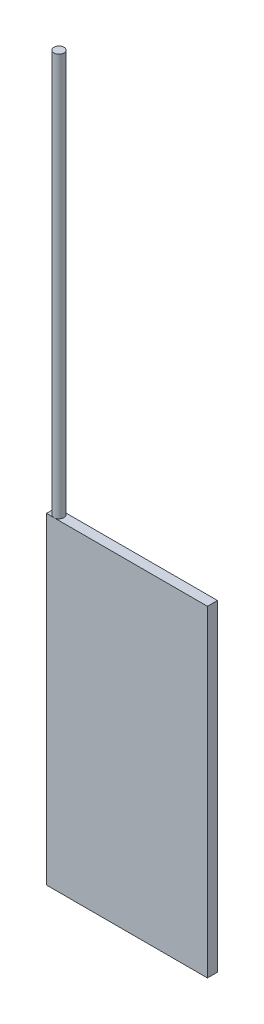
ISO-10303-21;
HEADER;
FILE_DESCRIPTION(('STEP AP214'),'2;1');
FILE_NAME('part.step','',(''),(''),'','','');
FILE_SCHEMA(('AUTOMOTIVE_DESIGN { 1 0 10303 214 1 1 1 1 }'));
ENDSEC;
DATA;
#1=APPLICATION_CONTEXT('core data for automotive mechanical design processes');
#2=APPLICATION_PROTOCOL_DEFINITION('international standard','automotive_design',2000,#1);
#3=PRODUCT_CONTEXT('',#1,'mechanical');
#4=PRODUCT('Part','Part','',(#3));
#5=PRODUCT_RELATED_PRODUCT_CATEGORY('part','',(#4));
#6=PRODUCT_DEFINITION_FORMATION('','',#4);
#7=PRODUCT_DEFINITION_CONTEXT('part definition',#1,'design');
#8=PRODUCT_DEFINITION('design','',#6,#7);
#9=PRODUCT_DEFINITION_SHAPE('','',#8);
#10=(LENGTH_UNIT() NAMED_UNIT(*) SI_UNIT(.MILLI.,.METRE.));
#11=(NAMED_UNIT(*) PLANE_ANGLE_UNIT() SI_UNIT($,.RADIAN.));
#12=(NAMED_UNIT(*) SI_UNIT($,.STERADIAN.) SOLID_ANGLE_UNIT());
#13=UNCERTAINTY_MEASURE_WITH_UNIT(LENGTH_MEASURE(1.E-05),#10,'distance_accuracy_value','');
#14=(GEOMETRIC_REPRESENTATION_CONTEXT(3) GLOBAL_UNCERTAINTY_ASSIGNED_CONTEXT((#13)) GLOBAL_UNIT_ASSIGNED_CONTEXT((#10,
#11,#12)) REPRESENTATION_CONTEXT('',''));
#15=CARTESIAN_POINT('',(0.,0.,0.));
#16=DIRECTION('',(0.,0.,1.));
#17=DIRECTION('',(1.,0.,0.));
#18=AXIS2_PLACEMENT_3D('',#15,#16,#17);
#19=CARTESIAN_POINT('',(0.,101.6,3.175));
#20=DIRECTION('',(0.,-1.,0.));
#21=DIRECTION('',(0.,0.,-1.));
#22=AXIS2_PLACEMENT_3D('',#19,#20,#21);
#23=PLANE('',#22);
#24=CARTESIAN_POINT('',(2.33921930998937,101.6,1.5875));
#25=DIRECTION('',(0.,1.,0.));
#26=DIRECTION('',(0.,0.,1.));
#27=AXIS2_PLACEMENT_3D('',#24,#25,#26);
#28=CIRCLE('',#27,1.5875);
#29=CARTESIAN_POINT('',(2.33921930998937,101.6,3.175));
#30=VERTEX_POINT('',#29);
#31=CARTESIAN_POINT('',(2.33921930998937,101.6,0.));
#32=VERTEX_POINT('',#31);
#33=EDGE_CURVE('E49',#30,#32,#28,.T.);
#34=ORIENTED_EDGE('',*,*,#33,.F.);
#35=DIRECTION('',(-1.,0.,0.));
#36=VECTOR('',#35,1.);
#37=CARTESIAN_POINT('',(0.,101.6,3.175));
#38=LINE('',#37,#36);
#39=CARTESIAN_POINT('',(50.8,101.6,3.175));
#40=VERTEX_POINT('',#39);
#41=EDGE_CURVE('E101',#40,#30,#38,.T.);
#42=ORIENTED_EDGE('',*,*,#41,.F.);
#43=DIRECTION('',(0.,0.,-1.));
#44=VECTOR('',#43,1.);
#45=CARTESIAN_POINT('',(50.8,101.6,3.175));
#46=LINE('',#45,#44);
#47=CARTESIAN_POINT('',(50.8,101.6,0.));
#48=VERTEX_POINT('',#47);
#49=EDGE_CURVE('E165',#40,#48,#46,.T.);
#50=ORIENTED_EDGE('',*,*,#49,.T.);
#51=DIRECTION('',(-1.,0.,0.));
#52=VECTOR('',#51,1.);
#53=CARTESIAN_POINT('',(0.,101.6,0.));
#54=LINE('',#53,#52);
#55=EDGE_CURVE('E118',#48,#32,#54,.T.);
#56=ORIENTED_EDGE('',*,*,#55,.T.);
#57=EDGE_LOOP('',(#34,#42,#50,#56));
#58=FACE_BOUND('',#57,.T.);
#59=ADVANCED_FACE('F38',(#58),#23,.F.);
#60=EDGE_CURVE('E11',#32,#30,#28,.T.);
#61=ORIENTED_EDGE('',*,*,#60,.F.);
#62=CARTESIAN_POINT('',(0.,101.6,0.));
#63=VERTEX_POINT('',#62);
#64=EDGE_CURVE('E88',#32,#63,#54,.T.);
#65=ORIENTED_EDGE('',*,*,#64,.T.);
#66=DIRECTION('',(0.,0.,-1.));
#67=VECTOR('',#66,1.);
#68=CARTESIAN_POINT('',(0.,101.6,3.175));
#69=LINE('',#68,#67);
#70=CARTESIAN_POINT('',(0.,101.6,3.175));
#71=VERTEX_POINT('',#70);
#72=EDGE_CURVE('E110',#71,#63,#69,.T.);
#73=ORIENTED_EDGE('',*,*,#72,.F.);
#74=EDGE_CURVE('E68',#30,#71,#38,.T.);
#75=ORIENTED_EDGE('',*,*,#74,.F.);
#76=EDGE_LOOP('',(#61,#65,#73,#75));
#77=FACE_BOUND('',#76,.T.);
#78=ADVANCED_FACE('F112',(#77),#23,.F.);
#79=CARTESIAN_POINT('',(0.,0.,3.175));
#80=DIRECTION('',(1.,0.,0.));
#81=DIRECTION('',(0.,0.,-1.));
#82=AXIS2_PLACEMENT_3D('',#79,#80,#81);
#83=PLANE('',#82);
#84=DIRECTION('',(0.,-1.,0.));
#85=VECTOR('',#84,1.);
#86=CARTESIAN_POINT('',(0.,0.,0.));
#87=LINE('',#86,#85);
#88=CARTESIAN_POINT('',(0.,0.,0.));
#89=VERTEX_POINT('',#88);
#90=EDGE_CURVE('E162',#63,#89,#87,.T.);
#91=ORIENTED_EDGE('',*,*,#90,.T.);
#92=DIRECTION('',(0.,0.,-1.));
#93=VECTOR('',#92,1.);
#94=CARTESIAN_POINT('',(0.,0.,3.175));
#95=LINE('',#94,#93);
#96=CARTESIAN_POINT('',(0.,0.,3.175));
#97=VERTEX_POINT('',#96);
#98=EDGE_CURVE('E42',#97,#89,#95,.T.);
#99=ORIENTED_EDGE('',*,*,#98,.F.);
#100=DIRECTION('',(0.,-1.,0.));
#101=VECTOR('',#100,1.);
#102=CARTESIAN_POINT('',(0.,0.,3.175));
#103=LINE('',#102,#101);
#104=EDGE_CURVE('E173',#71,#97,#103,.T.);
#105=ORIENTED_EDGE('',*,*,#104,.F.);
#106=ORIENTED_EDGE('',*,*,#72,.T.);
#107=EDGE_LOOP('',(#91,#99,#105,#106));
#108=FACE_BOUND('',#107,.T.);
#109=ADVANCED_FACE('F40',(#108),#83,.F.);
#110=CARTESIAN_POINT('',(0.,0.,3.175));
#111=DIRECTION('',(0.,1.,0.));
#112=DIRECTION('',(0.,0.,1.));
#113=AXIS2_PLACEMENT_3D('',#110,#111,#112);
#114=PLANE('',#113);
#115=DIRECTION('',(1.,0.,0.));
#116=VECTOR('',#115,1.);
#117=CARTESIAN_POINT('',(0.,0.,0.));
#118=LINE('',#117,#116);
#119=CARTESIAN_POINT('',(50.8,0.,0.));
#120=VERTEX_POINT('',#119);
#121=EDGE_CURVE('E153',#89,#120,#118,.T.);
#122=ORIENTED_EDGE('',*,*,#121,.T.);
#123=DIRECTION('',(0.,0.,-1.));
#124=VECTOR('',#123,1.);
#125=CARTESIAN_POINT('',(50.8,0.,3.175));
#126=LINE('',#125,#124);
#127=CARTESIAN_POINT('',(50.8,0.,3.175));
#128=VERTEX_POINT('',#127);
#129=EDGE_CURVE('E155',#128,#120,#126,.T.);
#130=ORIENTED_EDGE('',*,*,#129,.F.);
#131=DIRECTION('',(1.,0.,0.));
#132=VECTOR('',#131,1.);
#133=CARTESIAN_POINT('',(0.,0.,3.175));
#134=LINE('',#133,#132);
#135=EDGE_CURVE('E97',#97,#128,#134,.T.);
#136=ORIENTED_EDGE('',*,*,#135,.F.);
#137=ORIENTED_EDGE('',*,*,#98,.T.);
#138=EDGE_LOOP('',(#122,#130,#136,#137));
#139=FACE_BOUND('',#138,.T.);
#140=ADVANCED_FACE('F146',(#139),#114,.F.);
#141=CARTESIAN_POINT('',(50.8,0.,3.175));
#142=DIRECTION('',(-1.,0.,0.));
#143=DIRECTION('',(0.,0.,1.));
#144=AXIS2_PLACEMENT_3D('',#141,#142,#143);
#145=PLANE('',#144);
#146=DIRECTION('',(0.,1.,0.));
#147=VECTOR('',#146,1.);
#148=CARTESIAN_POINT('',(50.8,0.,0.));
#149=LINE('',#148,#147);
#150=EDGE_CURVE('E161',#120,#48,#149,.T.);
#151=ORIENTED_EDGE('',*,*,#150,.T.);
#152=ORIENTED_EDGE('',*,*,#49,.F.);
#153=DIRECTION('',(0.,1.,0.));
#154=VECTOR('',#153,1.);
#155=CARTESIAN_POINT('',(50.8,0.,3.175));
#156=LINE('',#155,#154);
#157=EDGE_CURVE('E104',#128,#40,#156,.T.);
#158=ORIENTED_EDGE('',*,*,#157,.F.);
#159=ORIENTED_EDGE('',*,*,#129,.T.);
#160=EDGE_LOOP('',(#151,#152,#158,#159));
#161=FACE_BOUND('',#160,.T.);
#162=ADVANCED_FACE('F144',(#161),#145,.F.);
#163=CARTESIAN_POINT('',(0.,0.,3.175));
#164=DIRECTION('',(0.,0.,-1.));
#165=DIRECTION('',(-1.,0.,0.));
#166=AXIS2_PLACEMENT_3D('',#163,#164,#165);
#167=PLANE('',#166);
#168=ORIENTED_EDGE('',*,*,#104,.T.);
#169=ORIENTED_EDGE('',*,*,#135,.T.);
#170=ORIENTED_EDGE('',*,*,#157,.T.);
#171=ORIENTED_EDGE('',*,*,#41,.T.);
#172=ORIENTED_EDGE('',*,*,#74,.T.);
#173=EDGE_LOOP('',(#168,#169,#170,#171,#172));
#174=FACE_BOUND('',#173,.T.);
#175=ADVANCED_FACE('F102',(#174),#167,.F.);
#176=CARTESIAN_POINT('',(0.,0.,0.));
#177=DIRECTION('',(0.,0.,-1.));
#178=DIRECTION('',(-1.,0.,0.));
#179=AXIS2_PLACEMENT_3D('',#176,#177,#178);
#180=PLANE('',#179);
#181=ORIENTED_EDGE('',*,*,#90,.F.);
#182=ORIENTED_EDGE('',*,*,#64,.F.);
#183=ORIENTED_EDGE('',*,*,#55,.F.);
#184=ORIENTED_EDGE('',*,*,#150,.F.);
#185=ORIENTED_EDGE('',*,*,#121,.F.);
#186=EDGE_LOOP('',(#181,#182,#183,#184,#185));
#187=FACE_BOUND('',#186,.T.);
#188=ADVANCED_FACE('F125',(#187),#180,.T.);
#189=CARTESIAN_POINT('',(2.33921930998937,228.6,1.5875));
#190=DIRECTION('',(0.,-1.,0.));
#191=DIRECTION('',(0.,0.,-1.));
#192=AXIS2_PLACEMENT_3D('',#189,#190,#191);
#193=CYLINDRICAL_SURFACE('',#192,1.5875);
#194=CARTESIAN_POINT('',(2.33921930998937,228.6,1.5875));
#195=DIRECTION('',(0.,1.,0.));
#196=DIRECTION('',(0.,0.,1.));
#197=AXIS2_PLACEMENT_3D('',#194,#195,#196);
#198=CIRCLE('',#197,1.5875);
#199=CARTESIAN_POINT('',(2.33921930998937,228.6,3.175));
#200=VERTEX_POINT('',#199);
#201=EDGE_CURVE('E121',#200,#200,#198,.T.);
#202=ORIENTED_EDGE('',*,*,#201,.F.);
#203=EDGE_LOOP('',(#202));
#204=FACE_BOUND('',#203,.T.);
#205=ORIENTED_EDGE('',*,*,#33,.T.);
#206=ORIENTED_EDGE('',*,*,#60,.T.);
#207=EDGE_LOOP('',(#205,#206));
#208=FACE_BOUND('',#207,.T.);
#209=ADVANCED_FACE('F122',(#204,#208),#193,.T.);
#210=CARTESIAN_POINT('',(2.33921930998937,228.6,1.5875));
#211=DIRECTION('',(0.,1.,0.));
#212=DIRECTION('',(0.,0.,1.));
#213=AXIS2_PLACEMENT_3D('',#210,#211,#212);
#214=PLANE('',#213);
#215=ORIENTED_EDGE('',*,*,#201,.T.);
#216=EDGE_LOOP('',(#215));
#217=FACE_BOUND('',#216,.T.);
#218=ADVANCED_FACE('F124',(#217),#214,.T.);
#219=CLOSED_SHELL('',(#59,#78,#109,#140,#162,#175,#188,#209,#218));
#220=MANIFOLD_SOLID_BREP('B2',#219);
#221=ADVANCED_BREP_SHAPE_REPRESENTATION('',(#18,#220),#14);
#222=SHAPE_DEFINITION_REPRESENTATION(#9,#221);
ENDSEC;
END-ISO-10303-21;
